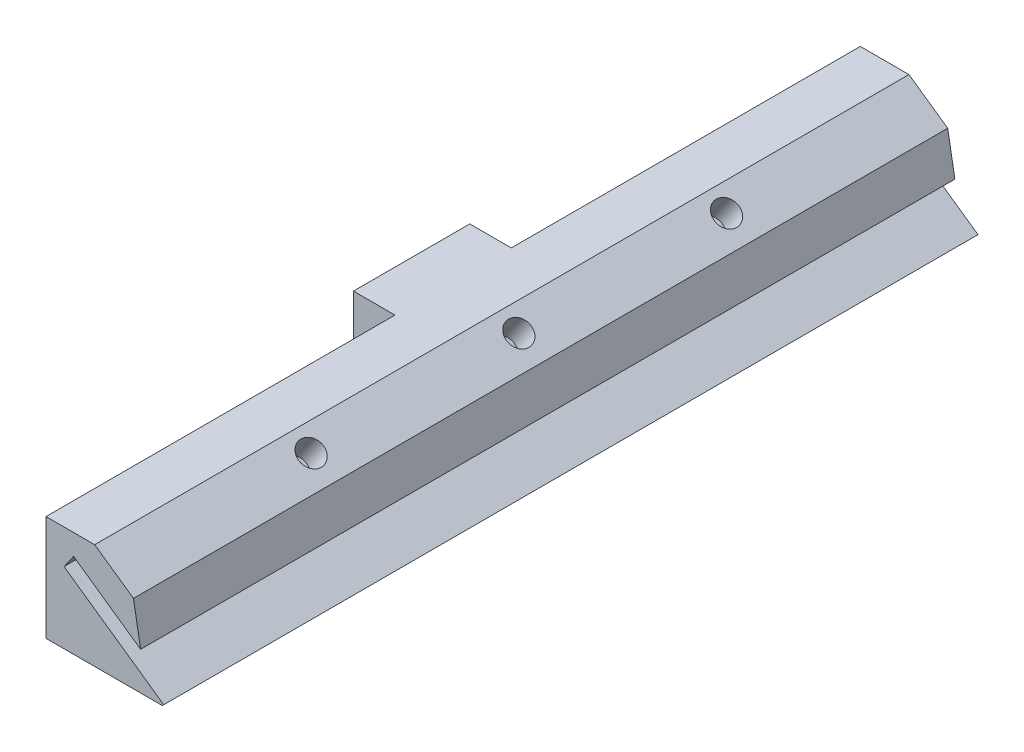
ISO-10303-21;
HEADER;
FILE_DESCRIPTION(('STEP AP214'),'2;1');
FILE_NAME('part.step','',(''),(''),'','','');
FILE_SCHEMA(('AUTOMOTIVE_DESIGN { 1 0 10303 214 1 1 1 1 }'));
ENDSEC;
DATA;
#1=APPLICATION_CONTEXT('core data for automotive mechanical design processes');
#2=APPLICATION_PROTOCOL_DEFINITION('international standard','automotive_design',2000,#1);
#3=PRODUCT_CONTEXT('',#1,'mechanical');
#4=PRODUCT('Part','Part','',(#3));
#5=PRODUCT_RELATED_PRODUCT_CATEGORY('part','',(#4));
#6=PRODUCT_DEFINITION_FORMATION('','',#4);
#7=PRODUCT_DEFINITION_CONTEXT('part definition',#1,'design');
#8=PRODUCT_DEFINITION('design','',#6,#7);
#9=PRODUCT_DEFINITION_SHAPE('','',#8);
#10=(LENGTH_UNIT() NAMED_UNIT(*) SI_UNIT(.MILLI.,.METRE.));
#11=(NAMED_UNIT(*) PLANE_ANGLE_UNIT() SI_UNIT($,.RADIAN.));
#12=(NAMED_UNIT(*) SI_UNIT($,.STERADIAN.) SOLID_ANGLE_UNIT());
#13=UNCERTAINTY_MEASURE_WITH_UNIT(LENGTH_MEASURE(1.E-05),#10,'distance_accuracy_value','');
#14=(GEOMETRIC_REPRESENTATION_CONTEXT(3) GLOBAL_UNCERTAINTY_ASSIGNED_CONTEXT((#13)) GLOBAL_UNIT_ASSIGNED_CONTEXT((#10,
#11,#12)) REPRESENTATION_CONTEXT('',''));
#15=CARTESIAN_POINT('',(0.,0.,0.));
#16=DIRECTION('',(0.,0.,1.));
#17=DIRECTION('',(1.,0.,0.));
#18=AXIS2_PLACEMENT_3D('',#15,#16,#17);
#19=CARTESIAN_POINT('',(0.,0.,98.));
#20=DIRECTION('',(0.,1.,0.));
#21=DIRECTION('',(0.,0.,1.));
#22=AXIS2_PLACEMENT_3D('',#19,#20,#21);
#23=PLANE('',#22);
#24=DIRECTION('',(1.,0.,0.));
#25=VECTOR('',#24,1.);
#26=CARTESIAN_POINT('',(0.,0.,0.));
#27=LINE('',#26,#25);
#28=CARTESIAN_POINT('',(70.,0.,0.));
#29=VERTEX_POINT('',#28);
#30=CARTESIAN_POINT('',(84.,0.,0.));
#31=VERTEX_POINT('',#30);
#32=EDGE_CURVE('E256',#29,#31,#27,.T.);
#33=ORIENTED_EDGE('',*,*,#32,.T.);
#34=DIRECTION('',(0.,0.,1.));
#35=VECTOR('',#34,1.);
#36=CARTESIAN_POINT('',(84.,0.,98.));
#37=LINE('',#36,#35);
#38=CARTESIAN_POINT('',(84.,0.,98.));
#39=VERTEX_POINT('',#38);
#40=EDGE_CURVE('E379',#31,#39,#37,.T.);
#41=ORIENTED_EDGE('',*,*,#40,.T.);
#42=DIRECTION('',(1.,0.,0.));
#43=VECTOR('',#42,1.);
#44=CARTESIAN_POINT('',(0.,0.,98.));
#45=LINE('',#44,#43);
#46=CARTESIAN_POINT('',(70.,0.,98.));
#47=VERTEX_POINT('',#46);
#48=EDGE_CURVE('E257',#47,#39,#45,.T.);
#49=ORIENTED_EDGE('',*,*,#48,.F.);
#50=DIRECTION('',(0.,0.,-1.));
#51=VECTOR('',#50,1.);
#52=CARTESIAN_POINT('',(70.,0.,98.));
#53=LINE('',#52,#51);
#54=CARTESIAN_POINT('',(70.,0.,73.9511017930718));
#55=VERTEX_POINT('',#54);
#56=EDGE_CURVE('E253',#47,#55,#53,.T.);
#57=ORIENTED_EDGE('',*,*,#56,.T.);
#58=CARTESIAN_POINT('',(66.25,0.,71.5));
#59=DIRECTION('',(0.,-1.,0.));
#60=DIRECTION('',(0.,0.,-1.));
#61=AXIS2_PLACEMENT_3D('',#58,#59,#60);
#62=CIRCLE('',#61,4.48);
#63=CARTESIAN_POINT('',(70.,0.,69.0488982069282));
#64=VERTEX_POINT('',#63);
#65=EDGE_CURVE('E225',#64,#55,#62,.T.);
#66=ORIENTED_EDGE('',*,*,#65,.F.);
#67=DIRECTION('',(0.,0.,1.));
#68=VECTOR('',#67,1.);
#69=CARTESIAN_POINT('',(70.,0.,0.));
#70=LINE('',#69,#68);
#71=CARTESIAN_POINT('',(70.,0.,56.));
#72=VERTEX_POINT('',#71);
#73=EDGE_CURVE('E196',#72,#64,#70,.T.);
#74=ORIENTED_EDGE('',*,*,#73,.F.);
#75=DIRECTION('',(-1.,0.,0.));
#76=VECTOR('',#75,1.);
#77=CARTESIAN_POINT('',(1.55513991706299E-13,0.,56.0000000000002));
#78=LINE('',#77,#76);
#79=CARTESIAN_POINT('',(65.,0.,56.));
#80=VERTEX_POINT('',#79);
#81=EDGE_CURVE('E199',#72,#80,#78,.T.);
#82=ORIENTED_EDGE('',*,*,#81,.T.);
#83=DIRECTION('',(0.,0.,1.));
#84=VECTOR('',#83,1.);
#85=CARTESIAN_POINT('',(65.,0.,0.));
#86=LINE('',#85,#84);
#87=CARTESIAN_POINT('',(65.,0.,42.));
#88=VERTEX_POINT('',#87);
#89=EDGE_CURVE('E205',#88,#80,#86,.T.);
#90=ORIENTED_EDGE('',*,*,#89,.F.);
#91=DIRECTION('',(-1.,0.,0.));
#92=VECTOR('',#91,1.);
#93=CARTESIAN_POINT('',(0.,0.,42.));
#94=LINE('',#93,#92);
#95=CARTESIAN_POINT('',(70.,0.,42.));
#96=VERTEX_POINT('',#95);
#97=EDGE_CURVE('E208',#96,#88,#94,.T.);
#98=ORIENTED_EDGE('',*,*,#97,.F.);
#99=CARTESIAN_POINT('',(70.,0.,28.9511017930718));
#100=VERTEX_POINT('',#99);
#101=EDGE_CURVE('E201',#100,#96,#70,.T.);
#102=ORIENTED_EDGE('',*,*,#101,.F.);
#103=CARTESIAN_POINT('',(66.25,0.,26.5));
#104=DIRECTION('',(0.,-1.,0.));
#105=DIRECTION('',(0.,0.,-1.));
#106=AXIS2_PLACEMENT_3D('',#103,#104,#105);
#107=CIRCLE('',#106,4.48);
#108=CARTESIAN_POINT('',(70.,0.,24.0488982069282));
#109=VERTEX_POINT('',#108);
#110=EDGE_CURVE('E239',#109,#100,#107,.T.);
#111=ORIENTED_EDGE('',*,*,#110,.F.);
#112=DIRECTION('',(0.,0.,-1.));
#113=VECTOR('',#112,1.);
#114=CARTESIAN_POINT('',(70.,0.,98.));
#115=LINE('',#114,#113);
#116=EDGE_CURVE('E249',#109,#29,#115,.T.);
#117=ORIENTED_EDGE('',*,*,#116,.T.);
#118=EDGE_LOOP('',(#33,#41,#49,#57,#66,#74,#82,#90,#98,#102,#111,#117));
#119=FACE_BOUND('',#118,.T.);
#120=ADVANCED_FACE('F41',(#119),#23,.F.);
#121=CARTESIAN_POINT('',(75.8625203143752,12.7,98.));
#122=DIRECTION('',(0.,-1.,0.));
#123=DIRECTION('',(1.,0.,0.));
#124=AXIS2_PLACEMENT_3D('',#121,#122,#123);
#125=PLANE('',#124);
#126=DIRECTION('',(0.,0.,-1.));
#127=VECTOR('',#126,1.);
#128=CARTESIAN_POINT('',(70.,12.7,0.));
#129=LINE('',#128,#127);
#130=CARTESIAN_POINT('',(70.,12.7,42.));
#131=VERTEX_POINT('',#130);
#132=CARTESIAN_POINT('',(70.,12.7,0.));
#133=VERTEX_POINT('',#132);
#134=EDGE_CURVE('E243',#131,#133,#129,.T.);
#135=ORIENTED_EDGE('',*,*,#134,.F.);
#136=DIRECTION('',(-1.,0.,0.));
#137=VECTOR('',#136,1.);
#138=CARTESIAN_POINT('',(0.,12.7,42.));
#139=LINE('',#138,#137);
#140=CARTESIAN_POINT('',(65.,12.7,42.));
#141=VERTEX_POINT('',#140);
#142=EDGE_CURVE('E200',#131,#141,#139,.T.);
#143=ORIENTED_EDGE('',*,*,#142,.T.);
#144=DIRECTION('',(0.,0.,1.));
#145=VECTOR('',#144,1.);
#146=CARTESIAN_POINT('',(65.,12.7,0.));
#147=LINE('',#146,#145);
#148=CARTESIAN_POINT('',(65.,12.7,56.));
#149=VERTEX_POINT('',#148);
#150=EDGE_CURVE('E214',#141,#149,#147,.T.);
#151=ORIENTED_EDGE('',*,*,#150,.T.);
#152=DIRECTION('',(-1.,0.,0.));
#153=VECTOR('',#152,1.);
#154=CARTESIAN_POINT('',(1.54061957944857E-13,12.7,56.0000000000002));
#155=LINE('',#154,#153);
#156=CARTESIAN_POINT('',(70.,12.7,56.));
#157=VERTEX_POINT('',#156);
#158=EDGE_CURVE('E193',#157,#149,#155,.T.);
#159=ORIENTED_EDGE('',*,*,#158,.F.);
#160=DIRECTION('',(0.,0.,-1.));
#161=VECTOR('',#160,1.);
#162=CARTESIAN_POINT('',(70.,12.7,98.));
#163=LINE('',#162,#161);
#164=CARTESIAN_POINT('',(70.,12.7,98.));
#165=VERTEX_POINT('',#164);
#166=EDGE_CURVE('E246',#165,#157,#163,.T.);
#167=ORIENTED_EDGE('',*,*,#166,.F.);
#168=DIRECTION('',(-1.,0.,0.));
#169=VECTOR('',#168,1.);
#170=CARTESIAN_POINT('',(75.8625203143752,12.7,98.));
#171=LINE('',#170,#169);
#172=CARTESIAN_POINT('',(75.8625203143752,12.7,98.));
#173=VERTEX_POINT('',#172);
#174=EDGE_CURVE('E264',#173,#165,#171,.T.);
#175=ORIENTED_EDGE('',*,*,#174,.F.);
#176=DIRECTION('',(0.,0.,-1.));
#177=VECTOR('',#176,1.);
#178=CARTESIAN_POINT('',(75.8625203143752,12.7,98.));
#179=LINE('',#178,#177);
#180=CARTESIAN_POINT('',(75.8625203143752,12.7,0.));
#181=VERTEX_POINT('',#180);
#182=EDGE_CURVE('E268',#173,#181,#179,.T.);
#183=ORIENTED_EDGE('',*,*,#182,.T.);
#184=DIRECTION('',(-1.,0.,0.));
#185=VECTOR('',#184,1.);
#186=CARTESIAN_POINT('',(75.8625203143752,12.7,0.));
#187=LINE('',#186,#185);
#188=EDGE_CURVE('E261',#181,#133,#187,.T.);
#189=ORIENTED_EDGE('',*,*,#188,.T.);
#190=EDGE_LOOP('',(#135,#143,#151,#159,#167,#175,#183,#189));
#191=FACE_BOUND('',#190,.T.);
#192=ADVANCED_FACE('F330',(#191),#125,.F.);
#193=CARTESIAN_POINT('',(66.25,0.,26.5));
#194=DIRECTION('',(0.,-1.,0.));
#195=DIRECTION('',(0.,0.,-1.));
#196=AXIS2_PLACEMENT_3D('',#193,#194,#195);
#197=CONICAL_SURFACE('',#196,4.48,0.785398163397448);
#198=CARTESIAN_POINT('',(70.,-9.25819654352928,13.2835124080322));
#199=CARTESIAN_POINT('',(70.,-9.00089450689383,13.5509831115955));
#200=CARTESIAN_POINT('',(70.,-8.74388293442788,13.8187340267274));
#201=CARTESIAN_POINT('',(70.,-8.23058606405541,14.3549355509981));
#202=CARTESIAN_POINT('',(70.,-7.97430077262864,14.6233861663387));
#203=CARTESIAN_POINT('',(70.,-7.46252523950135,15.1612068922258));
#204=CARTESIAN_POINT('',(70.,-7.20703527577106,15.4305772674212));
#205=CARTESIAN_POINT('',(70.,-6.69713776175974,15.970339217523));
#206=CARTESIAN_POINT('',(70.,-6.44273020746452,16.2407307886351));
#207=CARTESIAN_POINT('',(70.,-5.93713850895657,16.7807808487853));
#208=CARTESIAN_POINT('',(70.,-5.68594443055859,17.0504300309089));
#209=CARTESIAN_POINT('',(70.,-5.18524937524527,17.5912953289286));
#210=CARTESIAN_POINT('',(70.,-4.9357483910801,17.862511438106));
#211=CARTESIAN_POINT('',(70.,-4.43897562057331,18.4069146153301));
#212=CARTESIAN_POINT('',(70.,-4.1917035457354,18.6801014198162));
#213=CARTESIAN_POINT('',(70.,-3.70007973180988,19.2290868182485));
#214=CARTESIAN_POINT('',(70.,-3.45572793010169,19.5048853559623));
#215=CARTESIAN_POINT('',(70.,-3.03896471770185,19.9821953035927));
#216=CARTESIAN_POINT('',(70.,-2.86558606494325,20.182861178018));
#217=CARTESIAN_POINT('',(70.,-2.5214943472127,20.5864922176327));
#218=CARTESIAN_POINT('',(70.,-2.35078145158408,20.7894575274928));
#219=CARTESIAN_POINT('',(70.,-2.01207128991632,21.1992570954322));
#220=CARTESIAN_POINT('',(70.,-1.8440905153394,21.4061050344978));
#221=CARTESIAN_POINT('',(70.,-1.51293733577901,21.8235738301788));
#222=CARTESIAN_POINT('',(70.,-1.34976418734996,22.0341940952605));
#223=CARTESIAN_POINT('',(70.,-1.02875404939345,22.4621597098504));
#224=CARTESIAN_POINT('',(70.,-0.870970260548057,22.6795454091647));
#225=CARTESIAN_POINT('',(70.,-0.64157891719672,23.0108215228601));
#226=CARTESIAN_POINT('',(70.,-0.566296105589144,23.1221657865143));
#227=CARTESIAN_POINT('',(70.,-0.418751472257759,23.3468334231521));
#228=CARTESIAN_POINT('',(70.,-0.346489402275928,23.4601566324077));
#229=CARTESIAN_POINT('',(70.,-0.205948186151835,23.6886495568412));
#230=CARTESIAN_POINT('',(70.,-0.13765464552515,23.8038103787686));
#231=CARTESIAN_POINT('',(70.,-0.00562996269777898,24.0367525724955));
#232=CARTESIAN_POINT('',(70.,0.0581006149306448,24.1545342662185));
#233=CARTESIAN_POINT('',(70.,0.179762121609956,24.3928621733934));
#234=CARTESIAN_POINT('',(70.,0.23770136872309,24.5134041071));
#235=CARTESIAN_POINT('',(70.,0.346435291978937,24.757643401441));
#236=CARTESIAN_POINT('',(70.,0.397232749958334,24.8813395111715));
#237=CARTESIAN_POINT('',(70.,0.490789111202484,25.1342284123062));
#238=CARTESIAN_POINT('',(70.,0.533392970329582,25.2634793706198));
#239=CARTESIAN_POINT('',(70.,0.607398728692649,25.5251820159561));
#240=CARTESIAN_POINT('',(70.,0.638802422454779,25.6576331865961));
#241=CARTESIAN_POINT('',(70.,0.688269384234214,25.9240600553182));
#242=CARTESIAN_POINT('',(70.,0.706427714625054,26.0580177399635));
#243=CARTESIAN_POINT('',(70.,0.728410207128942,26.3271129166245));
#244=CARTESIAN_POINT('',(70.,0.732236351894513,26.4622502428609));
#245=CARTESIAN_POINT('',(70.,0.725235323973555,26.7325096600153));
#246=CARTESIAN_POINT('',(70.,0.714367655922155,26.8676306782649));
#247=CARTESIAN_POINT('',(70.,0.678775793860278,27.136021683185));
#248=CARTESIAN_POINT('',(70.,0.65404870335725,27.2692912769564));
#249=CARTESIAN_POINT('',(70.,0.592210160574027,27.533984552494));
#250=CARTESIAN_POINT('',(70.,0.555002209146926,27.6653852663179));
#251=CARTESIAN_POINT('',(70.,0.470326811227613,27.9247891608897));
#252=CARTESIAN_POINT('',(70.,0.422858851460229,28.0527921713016));
#253=CARTESIAN_POINT('',(70.,0.309898629982201,28.3292189799467));
#254=CARTESIAN_POINT('',(70.,0.242695401839126,28.4769369804708));
#255=CARTESIAN_POINT('',(70.,0.0993309603856919,28.7679976047597));
#256=CARTESIAN_POINT('',(70.,0.0231647027539037,28.9113377069735));
#257=CARTESIAN_POINT('',(70.,-0.136142396013391,29.1944359130306));
#258=CARTESIAN_POINT('',(70.,-0.21929695623237,29.3341862330285));
#259=CARTESIAN_POINT('',(70.,-0.390851530262659,29.6103694322713));
#260=CARTESIAN_POINT('',(70.,-0.479250533697821,29.7468029434265));
#261=CARTESIAN_POINT('',(70.,-0.661124333516546,30.0183706338679));
#262=CARTESIAN_POINT('',(70.,-0.754643639859436,30.1534748637406));
#263=CARTESIAN_POINT('',(70.,-0.944986735850401,30.4213333679893));
#264=CARTESIAN_POINT('',(70.,-1.04181064251311,30.5540875588981));
#265=CARTESIAN_POINT('',(70.,-1.23797173731846,30.8174539936083));
#266=CARTESIAN_POINT('',(70.,-1.33730551746968,30.9480687826873));
#267=CARTESIAN_POINT('',(70.,-1.53810706243647,31.2076393241753));
#268=CARTESIAN_POINT('',(70.,-1.63957478332961,31.3365951106432));
#269=CARTESIAN_POINT('',(70.,-1.89196196012583,31.6528896743193));
#270=CARTESIAN_POINT('',(70.,-2.04388716103889,31.8394253214957));
#271=CARTESIAN_POINT('',(70.,-2.35060879976086,32.2101250026945));
#272=CARTESIAN_POINT('',(70.,-2.50540535263071,32.3942889411746));
#273=CARTESIAN_POINT('',(70.,-2.81725946953392,32.76073119138));
#274=CARTESIAN_POINT('',(70.,-2.97431732713515,32.9430092529));
#275=CARTESIAN_POINT('',(70.,-3.29022035333551,33.306011374441));
#276=CARTESIAN_POINT('',(70.,-3.44906554444394,33.4867354148402));
#277=CARTESIAN_POINT('',(70.,-3.92810054774021,34.0274012087596));
#278=CARTESIAN_POINT('',(70.,-4.25044425489068,34.3854339147025));
#279=CARTESIAN_POINT('',(70.,-4.89898132948126,35.0979302753021));
#280=CARTESIAN_POINT('',(70.,-5.22517439518123,35.452394205721));
#281=CARTESIAN_POINT('',(70.,-5.85836441975288,36.1350620525341));
#282=CARTESIAN_POINT('',(70.,-6.16518166625486,36.4634328400374));
#283=CARTESIAN_POINT('',(70.,-6.78063833001674,37.1184754706726));
#284=CARTESIAN_POINT('',(70.,-7.08927779120388,37.4451472724877));
#285=CARTESIAN_POINT('',(70.,-7.70734795869553,38.0965311683999));
#286=CARTESIAN_POINT('',(70.,-8.01677594919554,38.4212458415082));
#287=CARTESIAN_POINT('',(70.,-8.6367299215493,39.06960312322));
#288=CARTESIAN_POINT('',(70.,-8.9472558632336,39.3932457702224));
#289=CARTESIAN_POINT('',(70.,-9.25819654352928,39.7164875919678));
#290=B_SPLINE_CURVE_WITH_KNOTS('',3,(#198,#199,#200,#201,#202,#203,#204,#205,#206,#207,#208,
#209,#210,#211,#212,#213,#214,#215,#216,#217,#218,#219,#220,#221,#222,#223,#224,#225,#226,#227,
#228,#229,#230,#231,#232,#233,#234,#235,#236,#237,#238,#239,#240,#241,#242,#243,#244,#245,#246,
#247,#248,#249,#250,#251,#252,#253,#254,#255,#256,#257,#258,#259,#260,#261,#262,#263,#264,#265,
#266,#267,#268,#269,#270,#271,#272,#273,#274,#275,#276,#277,#278,#279,#280,#281,#282,#283,#284,
#285,#286,#287,#288,#289),.UNSPECIFIED.,.F.,.F.,(4,2,2,2,2,2,2,2,2,2,2,2,2,2,2,2,2,2,2,2,2,2,2,
2,2,2,2,2,2,2,2,2,2,2,2,2,2,2,2,2,2,2,2,2,2,4),(0.,1.11342069586939,2.22685129442035,
3.34063506631482,4.45441470406266,5.55997794948413,6.66553645790259,7.77094975337886,
8.8763393023472,9.67189843971334,10.4675079113787,11.2668488175484,12.0660654588244,
12.8716827038498,13.2748639513972,13.6780119983041,14.0795924607378,14.4812225248855,
14.882267180469,15.2831551876169,15.6910102175159,16.0987998701951,16.5036332079203,
16.9084105406851,17.3143056950448,17.7202857094268,18.1294799360067,18.5386946379958,
19.0251473559474,19.511875166841,19.9995818765299,20.4871949295587,20.9800745508687,
21.4729716430024,21.9652320535222,22.4574823418553,23.1791696877118,23.9008860158009,
24.6226968990937,25.3445168829238,26.7897485569322,28.2348676861228,29.5830713084696,
30.9313075651001,32.2769152510502,33.6224742059528),.UNSPECIFIED.);
#291=EDGE_CURVE('E298',#109,#100,#290,.T.);
#292=ORIENTED_EDGE('',*,*,#291,.F.);
#293=ORIENTED_EDGE('',*,*,#110,.T.);
#294=EDGE_LOOP('',(#292,#293));
#295=FACE_BOUND('',#294,.T.);
#296=ADVANCED_FACE('F336',(#295),#197,.F.);
#297=CARTESIAN_POINT('',(66.25,0.,71.5));
#298=DIRECTION('',(0.,-1.,0.));
#299=DIRECTION('',(0.,0.,-1.));
#300=AXIS2_PLACEMENT_3D('',#297,#298,#299);
#301=CONICAL_SURFACE('',#300,4.48,0.785398163397448);
#302=CARTESIAN_POINT('',(70.,-9.25819654352928,58.2835124080322));
#303=CARTESIAN_POINT('',(70.,-9.00089450689383,58.5509831115955));
#304=CARTESIAN_POINT('',(70.,-8.74388293442788,58.8187340267274));
#305=CARTESIAN_POINT('',(70.,-8.2305860640554,59.3549355509981));
#306=CARTESIAN_POINT('',(70.,-7.97430077262864,59.6233861663387));
#307=CARTESIAN_POINT('',(70.,-7.46252523950134,60.1612068922258));
#308=CARTESIAN_POINT('',(70.,-7.20703527577105,60.4305772674212));
#309=CARTESIAN_POINT('',(70.,-6.69713776175973,60.970339217523));
#310=CARTESIAN_POINT('',(70.,-6.44273020746452,61.2407307886351));
#311=CARTESIAN_POINT('',(70.,-5.93713850895657,61.7807808487853));
#312=CARTESIAN_POINT('',(70.,-5.68594443055859,62.0504300309089));
#313=CARTESIAN_POINT('',(70.,-5.18524937524526,62.5912953289286));
#314=CARTESIAN_POINT('',(70.,-4.9357483910801,62.862511438106));
#315=CARTESIAN_POINT('',(70.,-4.43897562057331,63.4069146153301));
#316=CARTESIAN_POINT('',(70.,-4.1917035457354,63.6801014198162));
#317=CARTESIAN_POINT('',(70.,-3.70007973180988,64.2290868182485));
#318=CARTESIAN_POINT('',(70.,-3.45572793010169,64.5048853559623));
#319=CARTESIAN_POINT('',(70.,-3.03896471770184,64.9821953035927));
#320=CARTESIAN_POINT('',(70.,-2.86558606494325,65.1828611780181));
#321=CARTESIAN_POINT('',(70.,-2.5214943472127,65.5864922176327));
#322=CARTESIAN_POINT('',(70.,-2.35078145158408,65.7894575274929));
#323=CARTESIAN_POINT('',(70.,-2.01207128991632,66.1992570954322));
#324=CARTESIAN_POINT('',(70.,-1.8440905153394,66.4061050344978));
#325=CARTESIAN_POINT('',(70.,-1.51293733577901,66.8235738301788));
#326=CARTESIAN_POINT('',(70.,-1.34976418734996,67.0341940952605));
#327=CARTESIAN_POINT('',(70.,-1.02875404939345,67.4621597098504));
#328=CARTESIAN_POINT('',(70.,-0.870970260548057,67.6795454091647));
#329=CARTESIAN_POINT('',(70.,-0.641578917196723,68.0108215228601));
#330=CARTESIAN_POINT('',(70.,-0.566296105589147,68.1221657865143));
#331=CARTESIAN_POINT('',(70.,-0.418751472257763,68.3468334231521));
#332=CARTESIAN_POINT('',(70.,-0.346489402275933,68.4601566324077));
#333=CARTESIAN_POINT('',(70.,-0.205948186151842,68.6886495568411));
#334=CARTESIAN_POINT('',(70.,-0.137654645525159,68.8038103787686));
#335=CARTESIAN_POINT('',(70.,-0.0056299626977855,69.0367525724955));
#336=CARTESIAN_POINT('',(70.,0.058100614930642,69.1545342662185));
#337=CARTESIAN_POINT('',(70.,0.179762121609955,69.3928621733934));
#338=CARTESIAN_POINT('',(70.,0.237701368723087,69.5134041071));
#339=CARTESIAN_POINT('',(70.,0.346435291978934,69.757643401441));
#340=CARTESIAN_POINT('',(70.,0.397232749958335,69.8813395111715));
#341=CARTESIAN_POINT('',(70.,0.490789111202487,70.1342284123062));
#342=CARTESIAN_POINT('',(70.,0.533392970329583,70.2634793706198));
#343=CARTESIAN_POINT('',(70.,0.60739872869265,70.5251820159561));
#344=CARTESIAN_POINT('',(70.,0.638802422454781,70.6576331865961));
#345=CARTESIAN_POINT('',(70.,0.688269384234215,70.9240600553182));
#346=CARTESIAN_POINT('',(70.,0.706427714625055,71.0580177399635));
#347=CARTESIAN_POINT('',(70.,0.728410207128942,71.3271129166245));
#348=CARTESIAN_POINT('',(70.,0.732236351894513,71.462250242861));
#349=CARTESIAN_POINT('',(70.,0.725235323973554,71.7325096600153));
#350=CARTESIAN_POINT('',(70.,0.714367655922154,71.8676306782649));
#351=CARTESIAN_POINT('',(70.,0.678775793860277,72.1360216831851));
#352=CARTESIAN_POINT('',(70.,0.654048703357248,72.2692912769564));
#353=CARTESIAN_POINT('',(70.,0.592210160574027,72.533984552494));
#354=CARTESIAN_POINT('',(70.,0.555002209146927,72.6653852663179));
#355=CARTESIAN_POINT('',(70.,0.470326811227616,72.9247891608897));
#356=CARTESIAN_POINT('',(70.,0.422858851460231,73.0527921713016));
#357=CARTESIAN_POINT('',(70.,0.309898629982204,73.3292189799466));
#358=CARTESIAN_POINT('',(70.,0.242695401839129,73.4769369804708));
#359=CARTESIAN_POINT('',(70.,0.0993309603856971,73.7679976047597));
#360=CARTESIAN_POINT('',(70.,0.0231647027539101,73.9113377069735));
#361=CARTESIAN_POINT('',(70.,-0.136142396013386,74.1944359130305));
#362=CARTESIAN_POINT('',(70.,-0.219296956232367,74.3341862330285));
#363=CARTESIAN_POINT('',(70.,-0.390851530262657,74.6103694322713));
#364=CARTESIAN_POINT('',(70.,-0.479250533697817,74.7468029434265));
#365=CARTESIAN_POINT('',(70.,-0.661124333516543,75.0183706338679));
#366=CARTESIAN_POINT('',(70.,-0.754643639859436,75.1534748637406));
#367=CARTESIAN_POINT('',(70.,-0.944986735850403,75.4213333679893));
#368=CARTESIAN_POINT('',(70.,-1.04181064251311,75.5540875588981));
#369=CARTESIAN_POINT('',(70.,-1.23797173731845,75.8174539936083));
#370=CARTESIAN_POINT('',(70.,-1.33730551746967,75.9480687826873));
#371=CARTESIAN_POINT('',(70.,-1.53810706243646,76.2076393241753));
#372=CARTESIAN_POINT('',(70.,-1.63957478332961,76.3365951106432));
#373=CARTESIAN_POINT('',(70.,-1.89196196012583,76.6528896743193));
#374=CARTESIAN_POINT('',(70.,-2.04388716103889,76.8394253214957));
#375=CARTESIAN_POINT('',(70.,-2.35060879976086,77.2101250026945));
#376=CARTESIAN_POINT('',(70.,-2.50540535263071,77.3942889411746));
#377=CARTESIAN_POINT('',(70.,-2.81725946953392,77.76073119138));
#378=CARTESIAN_POINT('',(70.,-2.97431732713515,77.9430092529));
#379=CARTESIAN_POINT('',(70.,-3.29022035333551,78.306011374441));
#380=CARTESIAN_POINT('',(70.,-3.44906554444394,78.4867354148402));
#381=CARTESIAN_POINT('',(70.,-3.92810054774021,79.0274012087596));
#382=CARTESIAN_POINT('',(70.,-4.25044425489069,79.3854339147026));
#383=CARTESIAN_POINT('',(70.,-4.89898132948127,80.0979302753021));
#384=CARTESIAN_POINT('',(70.,-5.22517439518124,80.452394205721));
#385=CARTESIAN_POINT('',(70.,-5.85836441975288,81.1350620525341));
#386=CARTESIAN_POINT('',(70.,-6.16518166625487,81.4634328400374));
#387=CARTESIAN_POINT('',(70.,-6.78063833001675,82.1184754706726));
#388=CARTESIAN_POINT('',(70.,-7.0892777912039,82.4451472724877));
#389=CARTESIAN_POINT('',(70.,-7.70734795869555,83.0965311683999));
#390=CARTESIAN_POINT('',(70.,-8.01677594919555,83.4212458415082));
#391=CARTESIAN_POINT('',(70.,-8.63672992154931,84.06960312322));
#392=CARTESIAN_POINT('',(70.,-8.9472558632336,84.3932457702224));
#393=CARTESIAN_POINT('',(70.,-9.25819654352929,84.7164875919678));
#394=B_SPLINE_CURVE_WITH_KNOTS('',3,(#302,#303,#304,#305,#306,#307,#308,#309,#310,#311,#312,
#313,#314,#315,#316,#317,#318,#319,#320,#321,#322,#323,#324,#325,#326,#327,#328,#329,#330,#331,
#332,#333,#334,#335,#336,#337,#338,#339,#340,#341,#342,#343,#344,#345,#346,#347,#348,#349,#350,
#351,#352,#353,#354,#355,#356,#357,#358,#359,#360,#361,#362,#363,#364,#365,#366,#367,#368,#369,
#370,#371,#372,#373,#374,#375,#376,#377,#378,#379,#380,#381,#382,#383,#384,#385,#386,#387,#388,
#389,#390,#391,#392,#393),.UNSPECIFIED.,.F.,.F.,(4,2,2,2,2,2,2,2,2,2,2,2,2,2,2,2,2,2,2,2,2,2,2,
2,2,2,2,2,2,2,2,2,2,2,2,2,2,2,2,2,2,2,2,2,2,4),(0.,1.11342069586939,2.22685129442035,
3.34063506631482,4.45441470406266,5.55997794948413,6.6655364579026,7.77094975337886,
8.87633930234721,9.67189843971333,10.4675079113787,11.2668488175484,12.0660654588244,
12.8716827038498,13.2748639513972,13.6780119983041,14.0795924607378,14.4812225248855,
14.882267180469,15.2831551876169,15.691010217516,16.0987998701952,16.5036332079203,
16.9084105406851,17.3143056950448,17.7202857094268,18.1294799360067,18.5386946379958,
19.0251473559474,19.5118751668409,19.9995818765299,20.4871949295587,20.9800745508687,
21.4729716430024,21.9652320535222,22.4574823418553,23.1791696877118,23.9008860158009,
24.6226968990937,25.3445168829238,26.7897485569322,28.2348676861228,29.5830713084696,
30.9313075651001,32.2769152510502,33.6224742059528),.UNSPECIFIED.);
#395=EDGE_CURVE('E288',#64,#55,#394,.T.);
#396=ORIENTED_EDGE('',*,*,#395,.F.);
#397=ORIENTED_EDGE('',*,*,#65,.T.);
#398=EDGE_LOOP('',(#396,#397));
#399=FACE_BOUND('',#398,.T.);
#400=ADVANCED_FACE('F305',(#399),#301,.F.);
#401=CARTESIAN_POINT('',(0.,0.,98.));
#402=DIRECTION('',(0.,0.,1.));
#403=DIRECTION('',(1.,0.,0.));
#404=AXIS2_PLACEMENT_3D('',#401,#402,#403);
#405=PLANE('',#404);
#406=DIRECTION('',(-0.819152044288991,0.573576436351047,0.));
#407=VECTOR('',#406,1.);
#408=CARTESIAN_POINT('',(73.3180317814069,10.2089589910075,98.));
#409=LINE('',#408,#407);
#410=CARTESIAN_POINT('',(81.3862673735642,4.55951960932703,98.));
#411=VERTEX_POINT('',#410);
#412=CARTESIAN_POINT('',(73.3180317814069,10.2089589910075,98.));
#413=VERTEX_POINT('',#412);
#414=EDGE_CURVE('E178',#411,#413,#409,.T.);
#415=ORIENTED_EDGE('',*,*,#414,.F.);
#416=DIRECTION('',(0.173648177666933,-0.984807753012208,0.));
#417=VECTOR('',#416,1.);
#418=CARTESIAN_POINT('',(79.7118949040448,14.0553577549809,98.));
#419=LINE('',#418,#417);
#420=CARTESIAN_POINT('',(80.5267527457814,9.43406929156717,98.));
#421=VERTEX_POINT('',#420);
#422=EDGE_CURVE('E11',#411,#421,#419,.F.);
#423=ORIENTED_EDGE('',*,*,#422,.T.);
#424=DIRECTION('',(-0.819152044288991,0.573576436351047,0.));
#425=VECTOR('',#424,1.);
#426=CARTESIAN_POINT('',(75.8625203143752,12.7,98.));
#427=LINE('',#426,#425);
#428=EDGE_CURVE('E260',#421,#173,#427,.T.);
#429=ORIENTED_EDGE('',*,*,#428,.T.);
#430=ORIENTED_EDGE('',*,*,#174,.T.);
#431=DIRECTION('',(0.,1.,0.));
#432=VECTOR('',#431,1.);
#433=CARTESIAN_POINT('',(70.,0.,98.));
#434=LINE('',#433,#432);
#435=EDGE_CURVE('E285',#47,#165,#434,.T.);
#436=ORIENTED_EDGE('',*,*,#435,.F.);
#437=ORIENTED_EDGE('',*,*,#48,.T.);
#438=DIRECTION('',(-0.70710678118655,-0.707106781186545,0.));
#439=VECTOR('',#438,1.);
#440=CARTESIAN_POINT('',(41.9999999999997,-42.,98.));
#441=LINE('',#440,#439);
#442=CARTESIAN_POINT('',(84.1692823596184,0.169282359618418,98.));
#443=VERTEX_POINT('',#442);
#444=EDGE_CURVE('E176',#39,#443,#441,.F.);
#445=ORIENTED_EDGE('',*,*,#444,.T.);
#446=DIRECTION('',(0.819152044288991,-0.573576436351047,0.));
#447=VECTOR('',#446,1.);
#448=CARTESIAN_POINT('',(84.1692823596184,0.169282359618415,98.));
#449=LINE('',#448,#447);
#450=CARTESIAN_POINT('',(72.1708789087048,8.57065490242952,98.));
#451=VERTEX_POINT('',#450);
#452=EDGE_CURVE('E151',#451,#443,#449,.T.);
#453=ORIENTED_EDGE('',*,*,#452,.F.);
#454=DIRECTION('',(-0.573576436351046,-0.819152044288992,0.));
#455=VECTOR('',#454,1.);
#456=CARTESIAN_POINT('',(72.1708789087048,8.57065490242952,98.));
#457=LINE('',#456,#455);
#458=EDGE_CURVE('E164',#413,#451,#457,.T.);
#459=ORIENTED_EDGE('',*,*,#458,.F.);
#460=EDGE_LOOP('',(#415,#423,#429,#430,#436,#437,#445,#453,#459));
#461=FACE_BOUND('',#460,.T.);
#462=ADVANCED_FACE('F173',(#461),#405,.T.);
#463=CARTESIAN_POINT('',(0.,0.,0.));
#464=DIRECTION('',(0.,0.,1.));
#465=DIRECTION('',(1.,0.,0.));
#466=AXIS2_PLACEMENT_3D('',#463,#464,#465);
#467=PLANE('',#466);
#468=DIRECTION('',(-0.819152044288991,0.573576436351047,0.));
#469=VECTOR('',#468,1.);
#470=CARTESIAN_POINT('',(75.8625203143752,12.7,0.));
#471=LINE('',#470,#469);
#472=CARTESIAN_POINT('',(80.5267527457814,9.43406929156717,0.));
#473=VERTEX_POINT('',#472);
#474=EDGE_CURVE('E272',#473,#181,#471,.T.);
#475=ORIENTED_EDGE('',*,*,#474,.F.);
#476=DIRECTION('',(-0.173648177666933,0.984807753012208,0.));
#477=VECTOR('',#476,1.);
#478=CARTESIAN_POINT('',(80.5267527457814,9.43406929156717,0.));
#479=LINE('',#478,#477);
#480=CARTESIAN_POINT('',(81.3862673735642,4.55951960932703,0.));
#481=VERTEX_POINT('',#480);
#482=EDGE_CURVE('E65',#473,#481,#479,.F.);
#483=ORIENTED_EDGE('',*,*,#482,.T.);
#484=DIRECTION('',(-0.819152044288991,0.573576436351047,0.));
#485=VECTOR('',#484,1.);
#486=CARTESIAN_POINT('',(73.3180317814069,10.2089589910075,0.));
#487=LINE('',#486,#485);
#488=CARTESIAN_POINT('',(73.3180317814069,10.2089589910075,0.));
#489=VERTEX_POINT('',#488);
#490=EDGE_CURVE('E160',#481,#489,#487,.T.);
#491=ORIENTED_EDGE('',*,*,#490,.T.);
#492=DIRECTION('',(-0.573576436351046,-0.819152044288992,0.));
#493=VECTOR('',#492,1.);
#494=CARTESIAN_POINT('',(72.1708789087048,8.57065490242952,0.));
#495=LINE('',#494,#493);
#496=CARTESIAN_POINT('',(72.1708789087048,8.57065490242952,0.));
#497=VERTEX_POINT('',#496);
#498=EDGE_CURVE('E181',#489,#497,#495,.T.);
#499=ORIENTED_EDGE('',*,*,#498,.T.);
#500=DIRECTION('',(0.819152044288991,-0.573576436351047,0.));
#501=VECTOR('',#500,1.);
#502=CARTESIAN_POINT('',(84.1692823596184,0.169282359618415,0.));
#503=LINE('',#502,#501);
#504=CARTESIAN_POINT('',(84.1692823596184,0.169282359618415,0.));
#505=VERTEX_POINT('',#504);
#506=EDGE_CURVE('E154',#497,#505,#503,.T.);
#507=ORIENTED_EDGE('',*,*,#506,.T.);
#508=DIRECTION('',(0.70710678118655,0.707106781186545,0.));
#509=VECTOR('',#508,1.);
#510=CARTESIAN_POINT('',(88.1183650964577,4.11836509645769,0.));
#511=LINE('',#510,#509);
#512=EDGE_CURVE('E371',#505,#31,#511,.F.);
#513=ORIENTED_EDGE('',*,*,#512,.T.);
#514=ORIENTED_EDGE('',*,*,#32,.F.);
#515=DIRECTION('',(0.,1.,0.));
#516=VECTOR('',#515,1.);
#517=CARTESIAN_POINT('',(70.,0.,0.));
#518=LINE('',#517,#516);
#519=EDGE_CURVE('E281',#29,#133,#518,.T.);
#520=ORIENTED_EDGE('',*,*,#519,.T.);
#521=ORIENTED_EDGE('',*,*,#188,.F.);
#522=EDGE_LOOP('',(#475,#483,#491,#499,#507,#513,#514,#520,#521));
#523=FACE_BOUND('',#522,.T.);
#524=ADVANCED_FACE('F348',(#523),#467,.F.);
#525=CARTESIAN_POINT('',(75.8625203143752,12.7,98.));
#526=DIRECTION('',(-0.573576436351047,-0.819152044288991,0.));
#527=DIRECTION('',(0.819152044288991,-0.573576436351047,0.));
#528=AXIS2_PLACEMENT_3D('',#525,#526,#527);
#529=PLANE('',#528);
#530=CARTESIAN_POINT('',(77.9104004250977,11.2660589091224,74.));
#531=DIRECTION('',(0.573576436351047,0.819152044288991,0.));
#532=DIRECTION('',(-0.819152044288991,0.573576436351047,0.));
#533=AXIS2_PLACEMENT_3D('',#530,#531,#532);
#534=CIRCLE('',#533,1.5);
#535=CARTESIAN_POINT('',(76.6816723586642,12.126423563649,74.));
#536=VERTEX_POINT('',#535);
#537=EDGE_CURVE('E429',#536,#536,#534,.T.);
#538=ORIENTED_EDGE('',*,*,#537,.F.);
#539=EDGE_LOOP('',(#538));
#540=FACE_BOUND('',#539,.T.);
#541=CARTESIAN_POINT('',(77.9104004250977,11.2660589091224,49.));
#542=DIRECTION('',(0.573576436351047,0.819152044288991,0.));
#543=DIRECTION('',(-0.819152044288991,0.573576436351047,0.));
#544=AXIS2_PLACEMENT_3D('',#541,#542,#543);
#545=CIRCLE('',#544,1.5);
#546=CARTESIAN_POINT('',(76.6816723586642,12.126423563649,49.));
#547=VERTEX_POINT('',#546);
#548=EDGE_CURVE('E438',#547,#547,#545,.T.);
#549=ORIENTED_EDGE('',*,*,#548,.F.);
#550=EDGE_LOOP('',(#549));
#551=FACE_BOUND('',#550,.T.);
#552=CARTESIAN_POINT('',(77.9104004250977,11.2660589091224,24.));
#553=DIRECTION('',(0.573576436351047,0.819152044288991,0.));
#554=DIRECTION('',(-0.819152044288991,0.573576436351047,0.));
#555=AXIS2_PLACEMENT_3D('',#552,#553,#554);
#556=CIRCLE('',#555,1.5);
#557=CARTESIAN_POINT('',(76.6816723586642,12.126423563649,24.));
#558=VERTEX_POINT('',#557);
#559=EDGE_CURVE('E446',#558,#558,#556,.T.);
#560=ORIENTED_EDGE('',*,*,#559,.F.);
#561=EDGE_LOOP('',(#560));
#562=FACE_BOUND('',#561,.T.);
#563=ORIENTED_EDGE('',*,*,#428,.F.);
#564=DIRECTION('',(0.,0.,-1.));
#565=VECTOR('',#564,1.);
#566=CARTESIAN_POINT('',(80.5267527457814,9.43406929156717,0.));
#567=LINE('',#566,#565);
#568=EDGE_CURVE('E383',#421,#473,#567,.T.);
#569=ORIENTED_EDGE('',*,*,#568,.T.);
#570=ORIENTED_EDGE('',*,*,#474,.T.);
#571=ORIENTED_EDGE('',*,*,#182,.F.);
#572=EDGE_LOOP('',(#563,#569,#570,#571));
#573=FACE_BOUND('',#572,.T.);
#574=ADVANCED_FACE('F340',(#540,#551,#562,#573),#529,.F.);
#575=CARTESIAN_POINT('',(70.,-12.3,0.));
#576=DIRECTION('',(1.,0.,0.));
#577=DIRECTION('',(0.,1.,0.));
#578=AXIS2_PLACEMENT_3D('',#575,#576,#577);
#579=PLANE('',#578);
#580=ORIENTED_EDGE('',*,*,#116,.F.);
#581=ORIENTED_EDGE('',*,*,#291,.T.);
#582=ORIENTED_EDGE('',*,*,#101,.T.);
#583=DIRECTION('',(0.,1.,0.));
#584=VECTOR('',#583,1.);
#585=CARTESIAN_POINT('',(70.,0.,42.));
#586=LINE('',#585,#584);
#587=EDGE_CURVE('E221',#96,#131,#586,.T.);
#588=ORIENTED_EDGE('',*,*,#587,.T.);
#589=ORIENTED_EDGE('',*,*,#134,.T.);
#590=ORIENTED_EDGE('',*,*,#519,.F.);
#591=EDGE_LOOP('',(#580,#581,#582,#588,#589,#590));
#592=FACE_BOUND('',#591,.T.);
#593=ADVANCED_FACE('F347',(#592),#579,.F.);
#594=CARTESIAN_POINT('',(70.,-12.3,98.));
#595=DIRECTION('',(1.,0.,0.));
#596=DIRECTION('',(0.,1.,0.));
#597=AXIS2_PLACEMENT_3D('',#594,#595,#596);
#598=PLANE('',#597);
#599=ORIENTED_EDGE('',*,*,#435,.T.);
#600=ORIENTED_EDGE('',*,*,#166,.T.);
#601=DIRECTION('',(0.,1.,0.));
#602=VECTOR('',#601,1.);
#603=CARTESIAN_POINT('',(70.,0.,56.));
#604=LINE('',#603,#602);
#605=EDGE_CURVE('E232',#72,#157,#604,.T.);
#606=ORIENTED_EDGE('',*,*,#605,.F.);
#607=ORIENTED_EDGE('',*,*,#73,.T.);
#608=ORIENTED_EDGE('',*,*,#395,.T.);
#609=ORIENTED_EDGE('',*,*,#56,.F.);
#610=EDGE_LOOP('',(#599,#600,#606,#607,#608,#609));
#611=FACE_BOUND('',#610,.T.);
#612=ADVANCED_FACE('F317',(#611),#598,.F.);
#613=CARTESIAN_POINT('',(0.,0.,42.));
#614=DIRECTION('',(0.,0.,-1.));
#615=DIRECTION('',(-1.,0.,0.));
#616=AXIS2_PLACEMENT_3D('',#613,#614,#615);
#617=PLANE('',#616);
#618=ORIENTED_EDGE('',*,*,#142,.F.);
#619=ORIENTED_EDGE('',*,*,#587,.F.);
#620=ORIENTED_EDGE('',*,*,#97,.T.);
#621=DIRECTION('',(0.,1.,0.));
#622=VECTOR('',#621,1.);
#623=CARTESIAN_POINT('',(65.,0.,42.));
#624=LINE('',#623,#622);
#625=EDGE_CURVE('E226',#88,#141,#624,.T.);
#626=ORIENTED_EDGE('',*,*,#625,.T.);
#627=EDGE_LOOP('',(#618,#619,#620,#626));
#628=FACE_BOUND('',#627,.T.);
#629=ADVANCED_FACE('F312',(#628),#617,.T.);
#630=CARTESIAN_POINT('',(65.,0.,0.));
#631=DIRECTION('',(-1.,0.,0.));
#632=DIRECTION('',(0.,-1.,0.));
#633=AXIS2_PLACEMENT_3D('',#630,#631,#632);
#634=PLANE('',#633);
#635=ORIENTED_EDGE('',*,*,#150,.F.);
#636=ORIENTED_EDGE('',*,*,#625,.F.);
#637=ORIENTED_EDGE('',*,*,#89,.T.);
#638=DIRECTION('',(0.,1.,0.));
#639=VECTOR('',#638,1.);
#640=CARTESIAN_POINT('',(65.,0.,56.));
#641=LINE('',#640,#639);
#642=EDGE_CURVE('E229',#80,#149,#641,.T.);
#643=ORIENTED_EDGE('',*,*,#642,.T.);
#644=EDGE_LOOP('',(#635,#636,#637,#643));
#645=FACE_BOUND('',#644,.T.);
#646=ADVANCED_FACE('F316',(#645),#634,.T.);
#647=CARTESIAN_POINT('',(1.55513991706299E-13,0.,56.0000000000002));
#648=DIRECTION('',(0.,0.,-1.));
#649=DIRECTION('',(-1.,0.,0.));
#650=AXIS2_PLACEMENT_3D('',#647,#648,#649);
#651=PLANE('',#650);
#652=ORIENTED_EDGE('',*,*,#158,.T.);
#653=ORIENTED_EDGE('',*,*,#642,.F.);
#654=ORIENTED_EDGE('',*,*,#81,.F.);
#655=ORIENTED_EDGE('',*,*,#605,.T.);
#656=EDGE_LOOP('',(#652,#653,#654,#655));
#657=FACE_BOUND('',#656,.T.);
#658=ADVANCED_FACE('F320',(#657),#651,.F.);
#659=CARTESIAN_POINT('',(88.1183650964577,4.11836509645769,98.));
#660=DIRECTION('',(-0.707106781186545,0.70710678118655,0.));
#661=DIRECTION('',(0.,0.,-1.));
#662=AXIS2_PLACEMENT_3D('',#659,#660,#661);
#663=PLANE('',#662);
#664=DIRECTION('',(0.,0.,1.));
#665=VECTOR('',#664,1.);
#666=CARTESIAN_POINT('',(84.1692823596184,0.169282359618415,0.));
#667=LINE('',#666,#665);
#668=EDGE_CURVE('E159',#505,#443,#667,.T.);
#669=ORIENTED_EDGE('',*,*,#668,.T.);
#670=ORIENTED_EDGE('',*,*,#444,.F.);
#671=ORIENTED_EDGE('',*,*,#40,.F.);
#672=ORIENTED_EDGE('',*,*,#512,.F.);
#673=EDGE_LOOP('',(#669,#670,#671,#672));
#674=FACE_BOUND('',#673,.T.);
#675=ADVANCED_FACE('F323',(#674),#663,.F.);
#676=CARTESIAN_POINT('',(72.1708789087048,8.57065490242952,0.));
#677=DIRECTION('',(-0.819152044288992,0.573576436351046,0.));
#678=DIRECTION('',(-0.573576436351046,-0.819152044288992,0.));
#679=AXIS2_PLACEMENT_3D('',#676,#677,#678);
#680=PLANE('',#679);
#681=DIRECTION('',(0.,0.,1.));
#682=VECTOR('',#681,1.);
#683=CARTESIAN_POINT('',(72.1708789087048,8.57065490242952,0.));
#684=LINE('',#683,#682);
#685=EDGE_CURVE('E147',#497,#451,#684,.T.);
#686=ORIENTED_EDGE('',*,*,#685,.F.);
#687=ORIENTED_EDGE('',*,*,#498,.F.);
#688=DIRECTION('',(0.,0.,1.));
#689=VECTOR('',#688,1.);
#690=CARTESIAN_POINT('',(73.3180317814069,10.2089589910075,0.));
#691=LINE('',#690,#689);
#692=EDGE_CURVE('E167',#489,#413,#691,.T.);
#693=ORIENTED_EDGE('',*,*,#692,.T.);
#694=ORIENTED_EDGE('',*,*,#458,.T.);
#695=EDGE_LOOP('',(#686,#687,#693,#694));
#696=FACE_BOUND('',#695,.T.);
#697=ADVANCED_FACE('F165',(#696),#680,.F.);
#698=CARTESIAN_POINT('',(73.3180317814069,10.2089589910075,0.));
#699=DIRECTION('',(0.573576436351048,0.819152044288991,0.));
#700=DIRECTION('',(-0.819152044288991,0.573576436351048,0.));
#701=AXIS2_PLACEMENT_3D('',#698,#699,#700);
#702=PLANE('',#701);
#703=CARTESIAN_POINT('',(75.902882897869,8.39902675411092,74.));
#704=DIRECTION('',(0.573576436351048,0.819152044288991,0.));
#705=DIRECTION('',(-0.819152044288991,0.573576436351048,0.));
#706=AXIS2_PLACEMENT_3D('',#703,#704,#705);
#707=CIRCLE('',#706,1.5);
#708=CARTESIAN_POINT('',(74.6741548314355,9.2593914086375,74.));
#709=VERTEX_POINT('',#708);
#710=EDGE_CURVE('E170',#709,#709,#707,.F.);
#711=ORIENTED_EDGE('',*,*,#710,.F.);
#712=EDGE_LOOP('',(#711));
#713=FACE_BOUND('',#712,.T.);
#714=CARTESIAN_POINT('',(75.902882897869,8.39902675411092,49.));
#715=DIRECTION('',(0.573576436351048,0.819152044288991,0.));
#716=DIRECTION('',(-0.819152044288991,0.573576436351048,0.));
#717=AXIS2_PLACEMENT_3D('',#714,#715,#716);
#718=CIRCLE('',#717,1.5);
#719=CARTESIAN_POINT('',(74.6741548314355,9.2593914086375,49.));
#720=VERTEX_POINT('',#719);
#721=EDGE_CURVE('E435',#720,#720,#718,.F.);
#722=ORIENTED_EDGE('',*,*,#721,.F.);
#723=EDGE_LOOP('',(#722));
#724=FACE_BOUND('',#723,.T.);
#725=CARTESIAN_POINT('',(75.902882897869,8.39902675411092,24.));
#726=DIRECTION('',(0.573576436351048,0.819152044288991,0.));
#727=DIRECTION('',(-0.819152044288991,0.573576436351048,0.));
#728=AXIS2_PLACEMENT_3D('',#725,#726,#727);
#729=CIRCLE('',#728,1.5);
#730=CARTESIAN_POINT('',(74.6741548314355,9.2593914086375,24.));
#731=VERTEX_POINT('',#730);
#732=EDGE_CURVE('E442',#731,#731,#729,.F.);
#733=ORIENTED_EDGE('',*,*,#732,.F.);
#734=EDGE_LOOP('',(#733));
#735=FACE_BOUND('',#734,.T.);
#736=ORIENTED_EDGE('',*,*,#490,.F.);
#737=DIRECTION('',(0.,0.,-1.));
#738=VECTOR('',#737,1.);
#739=CARTESIAN_POINT('',(81.3862673735642,4.55951960932703,98.));
#740=LINE('',#739,#738);
#741=EDGE_CURVE('E51',#481,#411,#740,.F.);
#742=ORIENTED_EDGE('',*,*,#741,.T.);
#743=ORIENTED_EDGE('',*,*,#414,.T.);
#744=ORIENTED_EDGE('',*,*,#692,.F.);
#745=EDGE_LOOP('',(#736,#742,#743,#744));
#746=FACE_BOUND('',#745,.T.);
#747=ADVANCED_FACE('F411',(#713,#724,#735,#746),#702,.F.);
#748=CARTESIAN_POINT('',(84.1692823596184,0.169282359618415,0.));
#749=DIRECTION('',(-0.573576436351047,-0.819152044288992,0.));
#750=DIRECTION('',(0.819152044288992,-0.573576436351047,0.));
#751=AXIS2_PLACEMENT_3D('',#748,#749,#750);
#752=PLANE('',#751);
#753=ORIENTED_EDGE('',*,*,#668,.F.);
#754=ORIENTED_EDGE('',*,*,#506,.F.);
#755=ORIENTED_EDGE('',*,*,#685,.T.);
#756=ORIENTED_EDGE('',*,*,#452,.T.);
#757=EDGE_LOOP('',(#753,#754,#755,#756));
#758=FACE_BOUND('',#757,.T.);
#759=ADVANCED_FACE('F149',(#758),#752,.F.);
#760=CARTESIAN_POINT('',(80.5267527457814,9.43406929156717,98.));
#761=DIRECTION('',(-0.984807753012208,-0.173648177666933,0.));
#762=DIRECTION('',(0.,0.,-1.));
#763=AXIS2_PLACEMENT_3D('',#760,#761,#762);
#764=PLANE('',#763);
#765=ORIENTED_EDGE('',*,*,#422,.F.);
#766=ORIENTED_EDGE('',*,*,#741,.F.);
#767=ORIENTED_EDGE('',*,*,#482,.F.);
#768=ORIENTED_EDGE('',*,*,#568,.F.);
#769=EDGE_LOOP('',(#765,#766,#767,#768));
#770=FACE_BOUND('',#769,.T.);
#771=ADVANCED_FACE('F44',(#770),#764,.F.);
#772=CARTESIAN_POINT('',(68.2156145695778,-2.57953018622989,24.));
#773=DIRECTION('',(0.573576436351047,0.819152044288991,0.));
#774=DIRECTION('',(-0.819152044288991,0.573576436351047,0.));
#775=AXIS2_PLACEMENT_3D('',#772,#773,#774);
#776=CYLINDRICAL_SURFACE('',#775,1.5);
#777=ORIENTED_EDGE('',*,*,#559,.T.);
#778=EDGE_LOOP('',(#777));
#779=FACE_BOUND('',#778,.T.);
#780=ORIENTED_EDGE('',*,*,#732,.T.);
#781=EDGE_LOOP('',(#780));
#782=FACE_BOUND('',#781,.T.);
#783=ADVANCED_FACE('F403',(#779,#782),#776,.F.);
#784=CARTESIAN_POINT('',(68.2156145695778,-2.57953018622989,49.));
#785=DIRECTION('',(0.573576436351047,0.819152044288991,0.));
#786=DIRECTION('',(-0.819152044288991,0.573576436351047,0.));
#787=AXIS2_PLACEMENT_3D('',#784,#785,#786);
#788=CYLINDRICAL_SURFACE('',#787,1.5);
#789=ORIENTED_EDGE('',*,*,#548,.T.);
#790=EDGE_LOOP('',(#789));
#791=FACE_BOUND('',#790,.T.);
#792=ORIENTED_EDGE('',*,*,#721,.T.);
#793=EDGE_LOOP('',(#792));
#794=FACE_BOUND('',#793,.T.);
#795=ADVANCED_FACE('F408',(#791,#794),#788,.F.);
#796=CARTESIAN_POINT('',(68.2156145695778,-2.57953018622989,74.));
#797=DIRECTION('',(0.573576436351047,0.819152044288991,0.));
#798=DIRECTION('',(-0.819152044288991,0.573576436351047,0.));
#799=AXIS2_PLACEMENT_3D('',#796,#797,#798);
#800=CYLINDRICAL_SURFACE('',#799,1.5);
#801=ORIENTED_EDGE('',*,*,#537,.T.);
#802=EDGE_LOOP('',(#801));
#803=FACE_BOUND('',#802,.T.);
#804=ORIENTED_EDGE('',*,*,#710,.T.);
#805=EDGE_LOOP('',(#804));
#806=FACE_BOUND('',#805,.T.);
#807=ADVANCED_FACE('F420',(#803,#806),#800,.F.);
#808=CLOSED_SHELL('',(#120,#192,#296,#400,#462,#524,#574,#593,#612,#629,#646,#658,#675,#697,
#747,#759,#771,#783,#795,#807));
#809=MANIFOLD_SOLID_BREP('B2',#808);
#810=ADVANCED_BREP_SHAPE_REPRESENTATION('',(#18,#809),#14);
#811=SHAPE_DEFINITION_REPRESENTATION(#9,#810);
ENDSEC;
END-ISO-10303-21;
